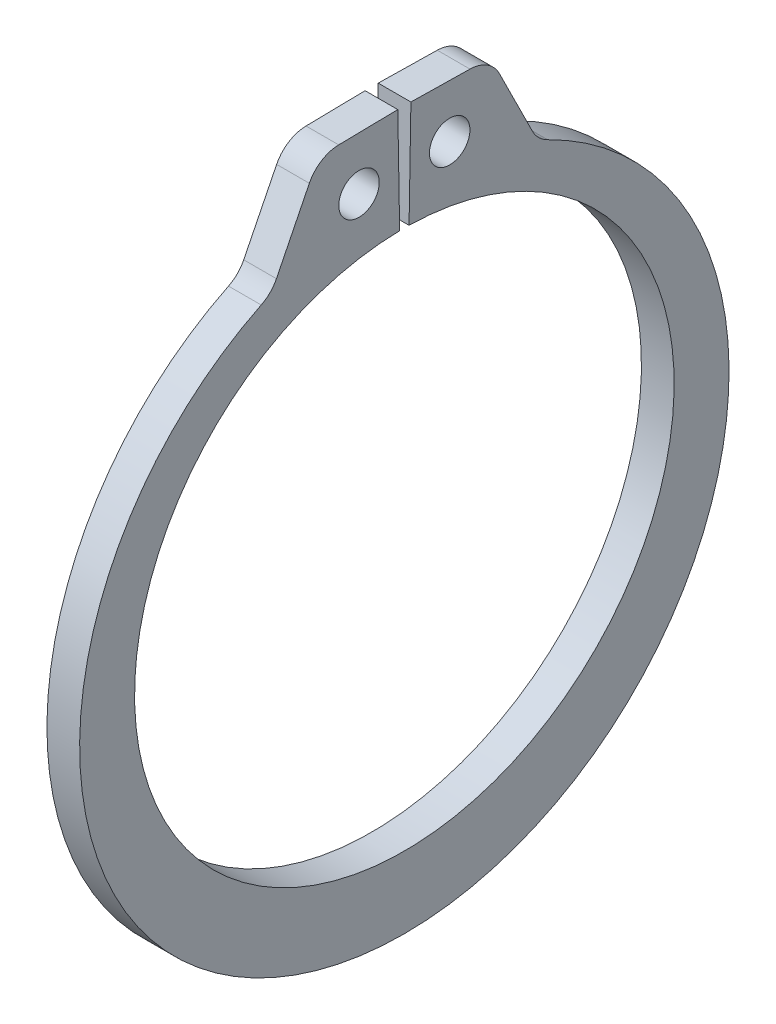
ISO-10303-21;
HEADER;
FILE_DESCRIPTION(('STEP AP214'),'2;1');
FILE_NAME('part.step','',(''),(''),'','','');
FILE_SCHEMA(('AUTOMOTIVE_DESIGN { 1 0 10303 214 1 1 1 1 }'));
ENDSEC;
DATA;
#1=APPLICATION_CONTEXT('core data for automotive mechanical design processes');
#2=APPLICATION_PROTOCOL_DEFINITION('international standard','automotive_design',2000,#1);
#3=PRODUCT_CONTEXT('',#1,'mechanical');
#4=PRODUCT('Part','Part','',(#3));
#5=PRODUCT_RELATED_PRODUCT_CATEGORY('part','',(#4));
#6=PRODUCT_DEFINITION_FORMATION('','',#4);
#7=PRODUCT_DEFINITION_CONTEXT('part definition',#1,'design');
#8=PRODUCT_DEFINITION('design','',#6,#7);
#9=PRODUCT_DEFINITION_SHAPE('','',#8);
#10=(LENGTH_UNIT() NAMED_UNIT(*) SI_UNIT(.MILLI.,.METRE.));
#11=(NAMED_UNIT(*) PLANE_ANGLE_UNIT() SI_UNIT($,.RADIAN.));
#12=(NAMED_UNIT(*) SI_UNIT($,.STERADIAN.) SOLID_ANGLE_UNIT());
#13=UNCERTAINTY_MEASURE_WITH_UNIT(LENGTH_MEASURE(1.E-05),#10,'distance_accuracy_value','');
#14=(GEOMETRIC_REPRESENTATION_CONTEXT(3) GLOBAL_UNCERTAINTY_ASSIGNED_CONTEXT((#13)) GLOBAL_UNIT_ASSIGNED_CONTEXT((#10,
#11,#12)) REPRESENTATION_CONTEXT('',''));
#15=CARTESIAN_POINT('',(0.,0.,0.));
#16=DIRECTION('',(0.,0.,1.));
#17=DIRECTION('',(1.,0.,0.));
#18=AXIS2_PLACEMENT_3D('',#15,#16,#17);
#19=CARTESIAN_POINT('',(0.5334,0.,0.));
#20=DIRECTION('',(1.,0.,0.));
#21=DIRECTION('',(0.,0.,-1.));
#22=AXIS2_PLACEMENT_3D('',#19,#20,#21);
#23=PLANE('',#22);
#24=CARTESIAN_POINT('',(0.5334,10.5040886416,-1.478946875));
#25=DIRECTION('',(-1.,0.,0.));
#26=DIRECTION('',(0.,0.,1.));
#27=AXIS2_PLACEMENT_3D('',#24,#25,#26);
#28=CIRCLE('',#27,0.6604);
#29=CARTESIAN_POINT('',(0.5334,10.5040886416,-0.818546875));
#30=VERTEX_POINT('',#29);
#31=EDGE_CURVE('E169',#30,#30,#28,.T.);
#32=ORIENTED_EDGE('',*,*,#31,.T.);
#33=EDGE_LOOP('',(#32));
#34=FACE_BOUND('',#33,.T.);
#35=CARTESIAN_POINT('',(0.5334,10.5040886416,1.478946875));
#36=DIRECTION('',(-1.,0.,0.));
#37=DIRECTION('',(0.,0.,1.));
#38=AXIS2_PLACEMENT_3D('',#35,#36,#37);
#39=CIRCLE('',#38,0.6604);
#40=CARTESIAN_POINT('',(0.5334,10.5040886416,2.139346875));
#41=VERTEX_POINT('',#40);
#42=EDGE_CURVE('E108',#41,#41,#39,.T.);
#43=ORIENTED_EDGE('',*,*,#42,.T.);
#44=EDGE_LOOP('',(#43));
#45=FACE_BOUND('',#44,.T.);
#46=CARTESIAN_POINT('',(0.5334,0.,0.));
#47=DIRECTION('',(-1.,0.,0.));
#48=DIRECTION('',(0.,0.,1.));
#49=AXIS2_PLACEMENT_3D('',#46,#47,#48);
#50=CIRCLE('',#49,8.8011);
#51=CARTESIAN_POINT('',(0.5334,8.79975954984145,-0.153600374264454));
#52=VERTEX_POINT('',#51);
#53=CARTESIAN_POINT('',(0.5334,8.79975954984046,0.153600374295008));
#54=VERTEX_POINT('',#53);
#55=EDGE_CURVE('E175',#52,#54,#50,.T.);
#56=ORIENTED_EDGE('',*,*,#55,.T.);
#57=DIRECTION('',(0.,-0.999847695156391,-0.0174524064373068));
#58=VECTOR('',#57,1.);
#59=CARTESIAN_POINT('',(0.5334,8.79975954984,0.153600374295));
#60=LINE('',#59,#58);
#61=CARTESIAN_POINT('',(0.5334,12.2536334281329,0.213887967141078));
#62=VERTEX_POINT('',#61);
#63=EDGE_CURVE('E123',#54,#62,#60,.F.);
#64=ORIENTED_EDGE('',*,*,#63,.T.);
#65=DIRECTION('',(0.,0.0174524064373068,-0.999847695156391));
#66=VECTOR('',#65,1.);
#67=CARTESIAN_POINT('',(0.5334,12.253633428,0.213887967092));
#68=LINE('',#67,#66);
#69=CARTESIAN_POINT('',(0.5334,12.2199997827526,2.1407582125059));
#70=VERTEX_POINT('',#69);
#71=EDGE_CURVE('E118',#62,#70,#68,.F.);
#72=ORIENTED_EDGE('',*,*,#71,.T.);
#73=CARTESIAN_POINT('',(0.5334,11.1279661301,2.12169669404));
#74=DIRECTION('',(-1.,0.,0.));
#75=DIRECTION('',(0.,0.,1.));
#76=AXIS2_PLACEMENT_3D('',#73,#74,#75);
#77=CIRCLE('',#76,1.0922);
#78=CARTESIAN_POINT('',(0.5334,11.6141614114072,3.09971253666751));
#79=VERTEX_POINT('',#78);
#80=EDGE_CURVE('E111',#79,#70,#77,.T.);
#81=ORIENTED_EDGE('',*,*,#80,.F.);
#82=DIRECTION('',(0.,0.895454900776261,-0.44515224437913));
#83=VECTOR('',#82,1.);
#84=CARTESIAN_POINT('',(0.5334,12.2084177334,2.8042933757));
#85=LINE('',#84,#83);
#86=CARTESIAN_POINT('',(0.5334,9.4553913777451,4.17288922568897));
#87=VERTEX_POINT('',#86);
#88=EDGE_CURVE('E106',#79,#87,#85,.F.);
#89=ORIENTED_EDGE('',*,*,#88,.T.);
#90=CARTESIAN_POINT('',(0.5334,9.94158665928,5.1509050682));
#91=DIRECTION('',(-1.,0.,0.));
#92=DIRECTION('',(0.,0.,1.));
#93=AXIS2_PLACEMENT_3D('',#90,#91,#92);
#94=CIRCLE('',#93,1.0922);
#95=CARTESIAN_POINT('',(0.5334,8.96124610533706,4.66941442621568));
#96=VERTEX_POINT('',#95);
#97=EDGE_CURVE('E20',#87,#96,#94,.T.);
#98=ORIENTED_EDGE('',*,*,#97,.T.);
#99=CARTESIAN_POINT('',(0.5334,-0.545929997487,0.));
#100=DIRECTION('',(-1.,0.,0.));
#101=DIRECTION('',(0.,0.,1.));
#102=AXIS2_PLACEMENT_3D('',#99,#100,#101);
#103=CIRCLE('',#102,10.5919700025);
#104=CARTESIAN_POINT('',(0.5334,8.96124610534191,-4.66941442621806));
#105=VERTEX_POINT('',#104);
#106=EDGE_CURVE('E181',#105,#96,#103,.T.);
#107=ORIENTED_EDGE('',*,*,#106,.F.);
#108=CARTESIAN_POINT('',(0.5334,9.94158665928,-5.1509050682));
#109=DIRECTION('',(-1.,0.,0.));
#110=DIRECTION('',(0.,0.,1.));
#111=AXIS2_PLACEMENT_3D('',#108,#109,#110);
#112=CIRCLE('',#111,1.0922);
#113=CARTESIAN_POINT('',(0.5334,9.4553913777451,-4.17288922568897));
#114=VERTEX_POINT('',#113);
#115=EDGE_CURVE('E179',#105,#114,#112,.T.);
#116=ORIENTED_EDGE('',*,*,#115,.T.);
#117=DIRECTION('',(0.,-0.895454900776261,-0.44515224437913));
#118=VECTOR('',#117,1.);
#119=CARTESIAN_POINT('',(0.5334,12.2084177334,-2.8042933757));
#120=LINE('',#119,#118);
#121=CARTESIAN_POINT('',(0.5334,11.6141614115509,-3.09971253659715));
#122=VERTEX_POINT('',#121);
#123=EDGE_CURVE('E142',#114,#122,#120,.F.);
#124=ORIENTED_EDGE('',*,*,#123,.T.);
#125=CARTESIAN_POINT('',(0.5334,11.1279661301,-2.12169669404));
#126=DIRECTION('',(-1.,0.,0.));
#127=DIRECTION('',(0.,0.,1.));
#128=AXIS2_PLACEMENT_3D('',#125,#126,#127);
#129=CIRCLE('',#128,1.0922);
#130=CARTESIAN_POINT('',(0.5334,12.2199997827607,-2.14075821235104));
#131=VERTEX_POINT('',#130);
#132=EDGE_CURVE('E144',#131,#122,#129,.T.);
#133=ORIENTED_EDGE('',*,*,#132,.F.);
#134=DIRECTION('',(0.,-0.0174524064373068,-0.999847695156391));
#135=VECTOR('',#134,1.);
#136=CARTESIAN_POINT('',(0.5334,12.253633428,-0.213887967092));
#137=LINE('',#136,#135);
#138=CARTESIAN_POINT('',(0.5334,12.2536334282671,-0.21388796712016));
#139=VERTEX_POINT('',#138);
#140=EDGE_CURVE('E136',#131,#139,#137,.F.);
#141=ORIENTED_EDGE('',*,*,#140,.T.);
#142=DIRECTION('',(0.,0.999847695156391,-0.0174524064373068));
#143=VECTOR('',#142,1.);
#144=CARTESIAN_POINT('',(0.5334,8.79975954984,-0.153600374295));
#145=LINE('',#144,#143);
#146=EDGE_CURVE('E129',#139,#52,#145,.F.);
#147=ORIENTED_EDGE('',*,*,#146,.T.);
#148=EDGE_LOOP('',(#56,#64,#72,#81,#89,#98,#107,#116,#124,#133,#141,#147));
#149=FACE_BOUND('',#148,.T.);
#150=ADVANCED_FACE('F17',(#34,#45,#149),#23,.T.);
#151=CARTESIAN_POINT('',(0.5334,9.94158665928,5.1509050682));
#152=DIRECTION('',(-1.,0.,0.));
#153=DIRECTION('',(0.,0.,1.));
#154=AXIS2_PLACEMENT_3D('',#151,#152,#153);
#155=CYLINDRICAL_SURFACE('',#154,1.0922);
#156=DIRECTION('',(1.,0.,0.));
#157=VECTOR('',#156,1.);
#158=CARTESIAN_POINT('',(0.5334,9.45539137751892,4.17288922580141));
#159=LINE('',#158,#157);
#160=CARTESIAN_POINT('',(-0.5334,9.45539137772939,4.17288922530929));
#161=VERTEX_POINT('',#160);
#162=EDGE_CURVE('E101',#87,#161,#159,.F.);
#163=ORIENTED_EDGE('',*,*,#162,.T.);
#164=CARTESIAN_POINT('',(-0.5334,9.94158665928,5.1509050682));
#165=DIRECTION('',(-1.,0.,0.));
#166=DIRECTION('',(0.,0.,1.));
#167=AXIS2_PLACEMENT_3D('',#164,#165,#166);
#168=CIRCLE('',#167,1.0922);
#169=CARTESIAN_POINT('',(-0.5334,8.96124610533706,4.66941442621568));
#170=VERTEX_POINT('',#169);
#171=EDGE_CURVE('E167',#161,#170,#168,.T.);
#172=ORIENTED_EDGE('',*,*,#171,.T.);
#173=DIRECTION('',(-1.,0.,0.));
#174=VECTOR('',#173,1.);
#175=CARTESIAN_POINT('',(0.5334,8.96124610533786,4.66941442621404));
#176=LINE('',#175,#174);
#177=EDGE_CURVE('E102',#96,#170,#176,.T.);
#178=ORIENTED_EDGE('',*,*,#177,.F.);
#179=ORIENTED_EDGE('',*,*,#97,.F.);
#180=EDGE_LOOP('',(#163,#172,#178,#179));
#181=FACE_BOUND('',#180,.T.);
#182=ADVANCED_FACE('F99',(#181),#155,.F.);
#183=CARTESIAN_POINT('',(0.5334,-0.545929997487,0.));
#184=DIRECTION('',(-1.,0.,0.));
#185=DIRECTION('',(0.,0.,1.));
#186=AXIS2_PLACEMENT_3D('',#183,#184,#185);
#187=CYLINDRICAL_SURFACE('',#186,10.5919700025);
#188=CARTESIAN_POINT('',(-0.5334,-0.545929997487,0.));
#189=DIRECTION('',(-1.,0.,0.));
#190=DIRECTION('',(0.,0.,1.));
#191=AXIS2_PLACEMENT_3D('',#188,#189,#190);
#192=CIRCLE('',#191,10.5919700025);
#193=CARTESIAN_POINT('',(-0.533400000073,8.96124610534757,-4.66941442621881));
#194=VERTEX_POINT('',#193);
#195=EDGE_CURVE('E165',#170,#194,#192,.F.);
#196=ORIENTED_EDGE('',*,*,#195,.T.);
#197=DIRECTION('',(-1.,0.,0.));
#198=VECTOR('',#197,1.);
#199=CARTESIAN_POINT('',(0.5334,8.96124610534757,-4.66941442621881));
#200=LINE('',#199,#198);
#201=EDGE_CURVE('E180',#194,#105,#200,.F.);
#202=ORIENTED_EDGE('',*,*,#201,.T.);
#203=ORIENTED_EDGE('',*,*,#106,.T.);
#204=ORIENTED_EDGE('',*,*,#177,.T.);
#205=EDGE_LOOP('',(#196,#202,#203,#204));
#206=FACE_BOUND('',#205,.T.);
#207=ADVANCED_FACE('F186',(#206),#187,.T.);
#208=CARTESIAN_POINT('',(0.5334,9.94158665928,-5.1509050682));
#209=DIRECTION('',(-1.,0.,0.));
#210=DIRECTION('',(0.,0.,1.));
#211=AXIS2_PLACEMENT_3D('',#208,#209,#210);
#212=CYLINDRICAL_SURFACE('',#211,1.0922);
#213=ORIENTED_EDGE('',*,*,#201,.F.);
#214=CARTESIAN_POINT('',(-0.5334,9.94158665928,-5.1509050682));
#215=DIRECTION('',(-1.,0.,0.));
#216=DIRECTION('',(0.,0.,1.));
#217=AXIS2_PLACEMENT_3D('',#214,#215,#216);
#218=CIRCLE('',#217,1.0922);
#219=CARTESIAN_POINT('',(-0.5334,9.45539137755326,-4.17288922539685));
#220=VERTEX_POINT('',#219);
#221=EDGE_CURVE('E162',#194,#220,#218,.T.);
#222=ORIENTED_EDGE('',*,*,#221,.T.);
#223=DIRECTION('',(1.,0.,0.));
#224=VECTOR('',#223,1.);
#225=CARTESIAN_POINT('',(0.5334,9.45539137751892,-4.17288922580141));
#226=LINE('',#225,#224);
#227=EDGE_CURVE('E145',#220,#114,#226,.T.);
#228=ORIENTED_EDGE('',*,*,#227,.T.);
#229=ORIENTED_EDGE('',*,*,#115,.F.);
#230=EDGE_LOOP('',(#213,#222,#228,#229));
#231=FACE_BOUND('',#230,.T.);
#232=ADVANCED_FACE('F197',(#231),#212,.F.);
#233=CARTESIAN_POINT('',(0.5334,12.2084177334,-2.8042933757));
#234=DIRECTION('',(0.,-0.44515224437913,0.895454900776261));
#235=DIRECTION('',(0.,-0.895454900776261,-0.44515224437913));
#236=AXIS2_PLACEMENT_3D('',#233,#234,#235);
#237=PLANE('',#236);
#238=ORIENTED_EDGE('',*,*,#227,.F.);
#239=DIRECTION('',(0.,0.895454900742227,0.445152244447591));
#240=VECTOR('',#239,1.);
#241=CARTESIAN_POINT('',(-0.5334,9.45539137721,-4.17288922518));
#242=LINE('',#241,#240);
#243=CARTESIAN_POINT('',(-0.5334,11.6141614113928,-3.09971253618533));
#244=VERTEX_POINT('',#243);
#245=EDGE_CURVE('E161',#220,#244,#242,.T.);
#246=ORIENTED_EDGE('',*,*,#245,.T.);
#247=DIRECTION('',(-1.,0.,0.));
#248=VECTOR('',#247,1.);
#249=CARTESIAN_POINT('',(0.5334,11.6141614116918,-3.09971253652817));
#250=LINE('',#249,#248);
#251=EDGE_CURVE('E178',#122,#244,#250,.T.);
#252=ORIENTED_EDGE('',*,*,#251,.F.);
#253=ORIENTED_EDGE('',*,*,#123,.F.);
#254=EDGE_LOOP('',(#238,#246,#252,#253));
#255=FACE_BOUND('',#254,.T.);
#256=ADVANCED_FACE('F202',(#255),#237,.F.);
#257=CARTESIAN_POINT('',(0.5334,11.1279661301,-2.12169669404));
#258=DIRECTION('',(-1.,0.,0.));
#259=DIRECTION('',(0.,0.,1.));
#260=AXIS2_PLACEMENT_3D('',#257,#258,#259);
#261=CYLINDRICAL_SURFACE('',#260,1.0922);
#262=CARTESIAN_POINT('',(-0.5334,11.1279661301,-2.12169669404));
#263=DIRECTION('',(-1.,0.,0.));
#264=DIRECTION('',(0.,0.,1.));
#265=AXIS2_PLACEMENT_3D('',#262,#263,#264);
#266=CIRCLE('',#265,1.0922);
#267=CARTESIAN_POINT('',(-0.5334,12.2199997827281,-2.14075821248141));
#268=VERTEX_POINT('',#267);
#269=EDGE_CURVE('E157',#244,#268,#266,.F.);
#270=ORIENTED_EDGE('',*,*,#269,.T.);
#271=DIRECTION('',(1.,0.,0.));
#272=VECTOR('',#271,1.);
#273=CARTESIAN_POINT('',(0.5334,12.2199997827607,-2.14075821235106));
#274=LINE('',#273,#272);
#275=EDGE_CURVE('E139',#268,#131,#274,.T.);
#276=ORIENTED_EDGE('',*,*,#275,.T.);
#277=ORIENTED_EDGE('',*,*,#132,.T.);
#278=ORIENTED_EDGE('',*,*,#251,.T.);
#279=EDGE_LOOP('',(#270,#276,#277,#278));
#280=FACE_BOUND('',#279,.T.);
#281=ADVANCED_FACE('F265',(#280),#261,.T.);
#282=CARTESIAN_POINT('',(0.5334,12.253633428,-0.213887967092));
#283=DIRECTION('',(0.,-0.999847695156391,0.0174524064373068));
#284=DIRECTION('',(0.,-0.0174524064373068,-0.999847695156391));
#285=AXIS2_PLACEMENT_3D('',#282,#283,#284);
#286=PLANE('',#285);
#287=ORIENTED_EDGE('',*,*,#275,.F.);
#288=DIRECTION('',(0.,0.0174524066770009,0.999847695152207));
#289=VECTOR('',#288,1.);
#290=CARTESIAN_POINT('',(-0.5334,12.2199997827,-2.14075821235));
#291=LINE('',#290,#289);
#292=CARTESIAN_POINT('',(-0.5334,12.2536334284004,-0.213887967145747));
#293=VERTEX_POINT('',#292);
#294=EDGE_CURVE('E160',#268,#293,#291,.T.);
#295=ORIENTED_EDGE('',*,*,#294,.T.);
#296=DIRECTION('',(1.,0.,0.));
#297=VECTOR('',#296,1.);
#298=CARTESIAN_POINT('',(0.5334,12.2536334284012,-0.213887967099241));
#299=LINE('',#298,#297);
#300=EDGE_CURVE('E133',#293,#139,#299,.T.);
#301=ORIENTED_EDGE('',*,*,#300,.T.);
#302=ORIENTED_EDGE('',*,*,#140,.F.);
#303=EDGE_LOOP('',(#287,#295,#301,#302));
#304=FACE_BOUND('',#303,.T.);
#305=ADVANCED_FACE('F263',(#304),#286,.F.);
#306=CARTESIAN_POINT('',(0.5334,8.79975954984,-0.153600374295));
#307=DIRECTION('',(0.,-0.0174524064373068,-0.999847695156391));
#308=DIRECTION('',(0.,0.999847695156391,-0.0174524064373068));
#309=AXIS2_PLACEMENT_3D('',#306,#307,#308);
#310=PLANE('',#309);
#311=DIRECTION('',(-1.,0.,0.));
#312=VECTOR('',#311,1.);
#313=CARTESIAN_POINT('',(0.5334,8.79975954984199,-0.153600374233892));
#314=LINE('',#313,#312);
#315=CARTESIAN_POINT('',(-0.5334,8.79975954984199,-0.153600374233893));
#316=VERTEX_POINT('',#315);
#317=EDGE_CURVE('E132',#316,#52,#314,.F.);
#318=ORIENTED_EDGE('',*,*,#317,.T.);
#319=ORIENTED_EDGE('',*,*,#146,.F.);
#320=ORIENTED_EDGE('',*,*,#300,.F.);
#321=DIRECTION('',(0.,-0.999847695155729,0.0174524064751953));
#322=VECTOR('',#321,1.);
#323=CARTESIAN_POINT('',(-0.5334,12.2536334284,-0.213887967169));
#324=LINE('',#323,#322);
#325=EDGE_CURVE('E156',#293,#316,#324,.T.);
#326=ORIENTED_EDGE('',*,*,#325,.T.);
#327=EDGE_LOOP('',(#318,#319,#320,#326));
#328=FACE_BOUND('',#327,.T.);
#329=ADVANCED_FACE('F258',(#328),#310,.F.);
#330=CARTESIAN_POINT('',(0.5334,0.,0.));
#331=DIRECTION('',(-1.,0.,0.));
#332=DIRECTION('',(0.,0.,1.));
#333=AXIS2_PLACEMENT_3D('',#330,#331,#332);
#334=CYLINDRICAL_SURFACE('',#333,8.8011);
#335=ORIENTED_EDGE('',*,*,#55,.F.);
#336=ORIENTED_EDGE('',*,*,#317,.F.);
#337=CARTESIAN_POINT('',(-0.5334,0.,0.));
#338=DIRECTION('',(-1.,0.,0.));
#339=DIRECTION('',(0.,0.,1.));
#340=AXIS2_PLACEMENT_3D('',#337,#338,#339);
#341=CIRCLE('',#340,8.8011);
#342=CARTESIAN_POINT('',(-0.533400000073,8.79975954984046,0.153600374295008));
#343=VERTEX_POINT('',#342);
#344=EDGE_CURVE('E153',#316,#343,#341,.T.);
#345=ORIENTED_EDGE('',*,*,#344,.T.);
#346=DIRECTION('',(1.,0.,0.));
#347=VECTOR('',#346,1.);
#348=CARTESIAN_POINT('',(0.5334,8.79975954984,0.153600374295));
#349=LINE('',#348,#347);
#350=EDGE_CURVE('E126',#343,#54,#349,.T.);
#351=ORIENTED_EDGE('',*,*,#350,.T.);
#352=EDGE_LOOP('',(#335,#336,#345,#351));
#353=FACE_BOUND('',#352,.T.);
#354=ADVANCED_FACE('F253',(#353),#334,.F.);
#355=CARTESIAN_POINT('',(0.5334,8.79975954984,0.153600374295));
#356=DIRECTION('',(0.,-0.0174524064373068,0.999847695156391));
#357=DIRECTION('',(0.,-0.999847695156391,-0.0174524064373068));
#358=AXIS2_PLACEMENT_3D('',#355,#356,#357);
#359=PLANE('',#358);
#360=DIRECTION('',(1.,0.,0.));
#361=VECTOR('',#360,1.);
#362=CARTESIAN_POINT('',(0.5334,12.2536334279988,0.213887967161997));
#363=LINE('',#362,#361);
#364=CARTESIAN_POINT('',(-0.5334,12.2536334282663,0.213887967166666));
#365=VERTEX_POINT('',#364);
#366=EDGE_CURVE('E120',#365,#62,#363,.T.);
#367=ORIENTED_EDGE('',*,*,#366,.T.);
#368=ORIENTED_EDGE('',*,*,#63,.F.);
#369=ORIENTED_EDGE('',*,*,#350,.F.);
#370=DIRECTION('',(0.,0.999847695156038,0.017452406457501));
#371=VECTOR('',#370,1.);
#372=CARTESIAN_POINT('',(-0.5334,8.79975954984,0.153600374295));
#373=LINE('',#372,#371);
#374=EDGE_CURVE('E155',#343,#365,#373,.T.);
#375=ORIENTED_EDGE('',*,*,#374,.T.);
#376=EDGE_LOOP('',(#367,#368,#369,#375));
#377=FACE_BOUND('',#376,.T.);
#378=ADVANCED_FACE('F250',(#377),#359,.F.);
#379=CARTESIAN_POINT('',(0.5334,12.253633428,0.213887967092));
#380=DIRECTION('',(0.,-0.999847695156391,-0.0174524064373068));
#381=DIRECTION('',(0.,0.0174524064373068,-0.999847695156391));
#382=AXIS2_PLACEMENT_3D('',#379,#380,#381);
#383=PLANE('',#382);
#384=DIRECTION('',(-1.,0.,0.));
#385=VECTOR('',#384,1.);
#386=CARTESIAN_POINT('',(0.5334,12.2199997827444,2.14075821266078));
#387=LINE('',#386,#385);
#388=CARTESIAN_POINT('',(-0.5334,12.2199997827226,2.14075821263478));
#389=VERTEX_POINT('',#388);
#390=EDGE_CURVE('E113',#70,#389,#387,.T.);
#391=ORIENTED_EDGE('',*,*,#390,.F.);
#392=ORIENTED_EDGE('',*,*,#71,.F.);
#393=ORIENTED_EDGE('',*,*,#366,.F.);
#394=DIRECTION('',(0.,-0.017452406674194,0.999847695152256));
#395=VECTOR('',#394,1.);
#396=CARTESIAN_POINT('',(-0.5334,12.2536334284,0.213887967169));
#397=LINE('',#396,#395);
#398=EDGE_CURVE('E152',#365,#389,#397,.T.);
#399=ORIENTED_EDGE('',*,*,#398,.T.);
#400=EDGE_LOOP('',(#391,#392,#393,#399));
#401=FACE_BOUND('',#400,.T.);
#402=ADVANCED_FACE('F243',(#401),#383,.F.);
#403=CARTESIAN_POINT('',(0.5334,11.1279661301,2.12169669404));
#404=DIRECTION('',(-1.,0.,0.));
#405=DIRECTION('',(0.,0.,1.));
#406=AXIS2_PLACEMENT_3D('',#403,#404,#405);
#407=CYLINDRICAL_SURFACE('',#406,1.0922);
#408=CARTESIAN_POINT('',(-0.5334,11.1279661301,2.12169669404));
#409=DIRECTION('',(-1.,0.,0.));
#410=DIRECTION('',(0.,0.,1.));
#411=AXIS2_PLACEMENT_3D('',#408,#409,#410);
#412=CIRCLE('',#411,1.0922);
#413=CARTESIAN_POINT('',(-0.5334,11.6141614112663,3.09971253673203));
#414=VERTEX_POINT('',#413);
#415=EDGE_CURVE('E149',#389,#414,#412,.F.);
#416=ORIENTED_EDGE('',*,*,#415,.T.);
#417=DIRECTION('',(1.,0.,0.));
#418=VECTOR('',#417,1.);
#419=CARTESIAN_POINT('',(0.5334,11.6141614114044,3.0997125366689));
#420=LINE('',#419,#418);
#421=EDGE_CURVE('E35',#414,#79,#420,.T.);
#422=ORIENTED_EDGE('',*,*,#421,.T.);
#423=ORIENTED_EDGE('',*,*,#80,.T.);
#424=ORIENTED_EDGE('',*,*,#390,.T.);
#425=EDGE_LOOP('',(#416,#422,#423,#424));
#426=FACE_BOUND('',#425,.T.);
#427=ADVANCED_FACE('F293',(#426),#407,.T.);
#428=CARTESIAN_POINT('',(0.5334,12.2084177334,2.8042933757));
#429=DIRECTION('',(0.,-0.44515224437913,-0.895454900776261));
#430=DIRECTION('',(0.,0.895454900776261,-0.44515224437913));
#431=AXIS2_PLACEMENT_3D('',#428,#429,#430);
#432=PLANE('',#431);
#433=ORIENTED_EDGE('',*,*,#162,.F.);
#434=ORIENTED_EDGE('',*,*,#88,.F.);
#435=ORIENTED_EDGE('',*,*,#421,.F.);
#436=DIRECTION('',(0.,-0.895454900902564,0.445152244125063));
#437=VECTOR('',#436,1.);
#438=CARTESIAN_POINT('',(-0.5334,11.6141614114,3.09971253666));
#439=LINE('',#438,#437);
#440=EDGE_CURVE('E107',#414,#161,#439,.T.);
#441=ORIENTED_EDGE('',*,*,#440,.T.);
#442=EDGE_LOOP('',(#433,#434,#435,#441));
#443=FACE_BOUND('',#442,.T.);
#444=ADVANCED_FACE('F105',(#443),#432,.F.);
#445=CARTESIAN_POINT('',(0.5334,10.5040886416,1.478946875));
#446=DIRECTION('',(-1.,0.,0.));
#447=DIRECTION('',(0.,0.,1.));
#448=AXIS2_PLACEMENT_3D('',#445,#446,#447);
#449=CYLINDRICAL_SURFACE('',#448,0.6604);
#450=CARTESIAN_POINT('',(-0.533400000146,10.5040886416,1.478946875));
#451=DIRECTION('',(-1.,0.,0.));
#452=DIRECTION('',(0.,0.,1.));
#453=AXIS2_PLACEMENT_3D('',#450,#451,#452);
#454=CIRCLE('',#453,0.6604);
#455=CARTESIAN_POINT('',(-0.533400000146,10.5040886416,2.139346875));
#456=VERTEX_POINT('',#455);
#457=EDGE_CURVE('E26',#456,#456,#454,.T.);
#458=ORIENTED_EDGE('',*,*,#457,.T.);
#459=EDGE_LOOP('',(#458));
#460=FACE_BOUND('',#459,.T.);
#461=ORIENTED_EDGE('',*,*,#42,.F.);
#462=EDGE_LOOP('',(#461));
#463=FACE_BOUND('',#462,.T.);
#464=ADVANCED_FACE('F282',(#460,#463),#449,.F.);
#465=CARTESIAN_POINT('',(0.5334,10.5040886416,-1.478946875));
#466=DIRECTION('',(-1.,0.,0.));
#467=DIRECTION('',(0.,0.,1.));
#468=AXIS2_PLACEMENT_3D('',#465,#466,#467);
#469=CYLINDRICAL_SURFACE('',#468,0.6604);
#470=CARTESIAN_POINT('',(-0.5334,10.5040886416,-1.478946875));
#471=DIRECTION('',(-1.,0.,0.));
#472=DIRECTION('',(0.,0.,1.));
#473=AXIS2_PLACEMENT_3D('',#470,#471,#472);
#474=CIRCLE('',#473,0.6604);
#475=CARTESIAN_POINT('',(-0.5334,10.5040886416,-0.818546875));
#476=VERTEX_POINT('',#475);
#477=EDGE_CURVE('E11',#476,#476,#474,.T.);
#478=ORIENTED_EDGE('',*,*,#477,.T.);
#479=EDGE_LOOP('',(#478));
#480=FACE_BOUND('',#479,.T.);
#481=ORIENTED_EDGE('',*,*,#31,.F.);
#482=EDGE_LOOP('',(#481));
#483=FACE_BOUND('',#482,.T.);
#484=ADVANCED_FACE('F276',(#480,#483),#469,.F.);
#485=CARTESIAN_POINT('',(-0.5334,0.,0.));
#486=DIRECTION('',(1.,0.,0.));
#487=DIRECTION('',(0.,0.,-1.));
#488=AXIS2_PLACEMENT_3D('',#485,#486,#487);
#489=PLANE('',#488);
#490=ORIENTED_EDGE('',*,*,#477,.F.);
#491=EDGE_LOOP('',(#490));
#492=FACE_BOUND('',#491,.T.);
#493=ORIENTED_EDGE('',*,*,#457,.F.);
#494=EDGE_LOOP('',(#493));
#495=FACE_BOUND('',#494,.T.);
#496=ORIENTED_EDGE('',*,*,#415,.F.);
#497=ORIENTED_EDGE('',*,*,#398,.F.);
#498=ORIENTED_EDGE('',*,*,#374,.F.);
#499=ORIENTED_EDGE('',*,*,#344,.F.);
#500=ORIENTED_EDGE('',*,*,#325,.F.);
#501=ORIENTED_EDGE('',*,*,#294,.F.);
#502=ORIENTED_EDGE('',*,*,#269,.F.);
#503=ORIENTED_EDGE('',*,*,#245,.F.);
#504=ORIENTED_EDGE('',*,*,#221,.F.);
#505=ORIENTED_EDGE('',*,*,#195,.F.);
#506=ORIENTED_EDGE('',*,*,#171,.F.);
#507=ORIENTED_EDGE('',*,*,#440,.F.);
#508=EDGE_LOOP('',(#496,#497,#498,#499,#500,#501,#502,#503,#504,#505,#506,#507));
#509=FACE_BOUND('',#508,.T.);
#510=ADVANCED_FACE('F191',(#492,#495,#509),#489,.F.);
#511=CLOSED_SHELL('',(#150,#182,#207,#232,#256,#281,#305,#329,#354,#378,#402,#427,#444,#464,
#484,#510));
#512=MANIFOLD_SOLID_BREP('B1',#511);
#513=ADVANCED_BREP_SHAPE_REPRESENTATION('',(#18,#512),#14);
#514=SHAPE_DEFINITION_REPRESENTATION(#9,#513);
ENDSEC;
END-ISO-10303-21;
